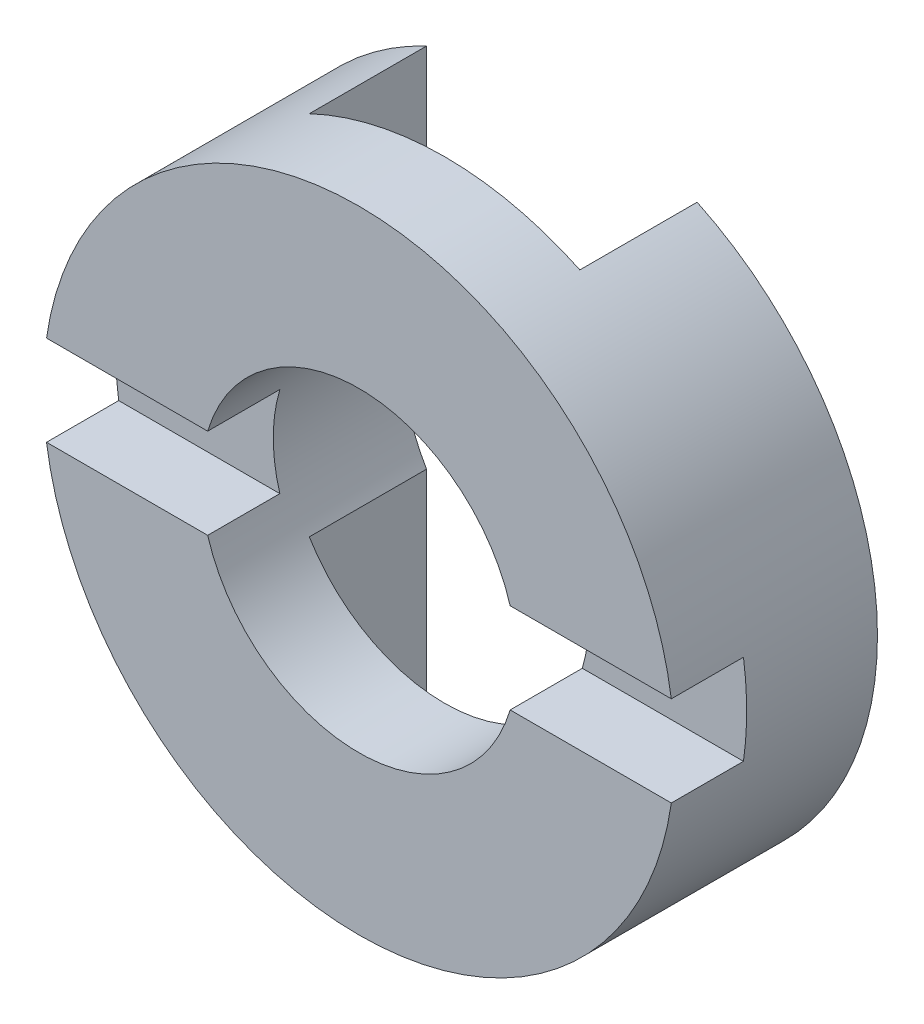
ISO-10303-21;
HEADER;
FILE_DESCRIPTION(('STEP AP214'),'2;1');
FILE_NAME('part.step','',(''),(''),'','','');
FILE_SCHEMA(('AUTOMOTIVE_DESIGN { 1 0 10303 214 1 1 1 1 }'));
ENDSEC;
DATA;
#1=APPLICATION_CONTEXT('core data for automotive mechanical design processes');
#2=APPLICATION_PROTOCOL_DEFINITION('international standard','automotive_design',2000,#1);
#3=PRODUCT_CONTEXT('',#1,'mechanical');
#4=PRODUCT('Part','Part','',(#3));
#5=PRODUCT_RELATED_PRODUCT_CATEGORY('part','',(#4));
#6=PRODUCT_DEFINITION_FORMATION('','',#4);
#7=PRODUCT_DEFINITION_CONTEXT('part definition',#1,'design');
#8=PRODUCT_DEFINITION('design','',#6,#7);
#9=PRODUCT_DEFINITION_SHAPE('','',#8);
#10=(LENGTH_UNIT() NAMED_UNIT(*) SI_UNIT(.MILLI.,.METRE.));
#11=(NAMED_UNIT(*) PLANE_ANGLE_UNIT() SI_UNIT($,.RADIAN.));
#12=(NAMED_UNIT(*) SI_UNIT($,.STERADIAN.) SOLID_ANGLE_UNIT());
#13=UNCERTAINTY_MEASURE_WITH_UNIT(LENGTH_MEASURE(1.E-05),#10,'distance_accuracy_value','');
#14=(GEOMETRIC_REPRESENTATION_CONTEXT(3) GLOBAL_UNCERTAINTY_ASSIGNED_CONTEXT((#13)) GLOBAL_UNIT_ASSIGNED_CONTEXT((#10,
#11,#12)) REPRESENTATION_CONTEXT('',''));
#15=CARTESIAN_POINT('',(0.,0.,0.));
#16=DIRECTION('',(0.,0.,1.));
#17=DIRECTION('',(1.,0.,0.));
#18=AXIS2_PLACEMENT_3D('',#15,#16,#17);
#19=CARTESIAN_POINT('',(0.,-15.5414213562373,4.5));
#20=DIRECTION('',(0.,0.,1.));
#21=DIRECTION('',(1.,0.,0.));
#22=AXIS2_PLACEMENT_3D('',#19,#20,#21);
#23=PLANE('',#22);
#24=DIRECTION('',(-1.,0.,0.));
#25=VECTOR('',#24,1.);
#26=CARTESIAN_POINT('',(0.,0.999999999999999,4.5));
#27=LINE('',#26,#25);
#28=CARTESIAN_POINT('',(6.92820323027551,1.,4.5));
#29=VERTEX_POINT('',#28);
#30=CARTESIAN_POINT('',(3.35410196624969,1.,4.5));
#31=VERTEX_POINT('',#30);
#32=EDGE_CURVE('E243',#29,#31,#27,.T.);
#33=ORIENTED_EDGE('',*,*,#32,.F.);
#34=CARTESIAN_POINT('',(0.,0.,4.5));
#35=DIRECTION('',(0.,0.,1.));
#36=DIRECTION('',(1.,0.,0.));
#37=AXIS2_PLACEMENT_3D('',#34,#35,#36);
#38=CIRCLE('',#37,7.);
#39=CARTESIAN_POINT('',(-6.92820323027551,1.,4.5));
#40=VERTEX_POINT('',#39);
#41=EDGE_CURVE('E217',#40,#29,#38,.F.);
#42=ORIENTED_EDGE('',*,*,#41,.F.);
#43=CARTESIAN_POINT('',(-3.35410196624968,1.,4.5));
#44=VERTEX_POINT('',#43);
#45=EDGE_CURVE('E242',#44,#40,#27,.T.);
#46=ORIENTED_EDGE('',*,*,#45,.F.);
#47=CARTESIAN_POINT('',(0.,0.,4.5));
#48=DIRECTION('',(0.,0.,1.));
#49=DIRECTION('',(1.,0.,0.));
#50=AXIS2_PLACEMENT_3D('',#47,#48,#49);
#51=CIRCLE('',#50,3.5);
#52=EDGE_CURVE('E214',#31,#44,#51,.T.);
#53=ORIENTED_EDGE('',*,*,#52,.F.);
#54=EDGE_LOOP('',(#33,#42,#46,#53));
#55=FACE_BOUND('',#54,.T.);
#56=ADVANCED_FACE('F33',(#55),#23,.T.);
#57=CARTESIAN_POINT('',(0.,-15.5414213562373,0.));
#58=DIRECTION('',(0.,0.,1.));
#59=DIRECTION('',(1.,0.,0.));
#60=AXIS2_PLACEMENT_3D('',#57,#58,#59);
#61=PLANE('',#60);
#62=CARTESIAN_POINT('',(0.,0.,0.));
#63=DIRECTION('',(0.,0.,1.));
#64=DIRECTION('',(1.,0.,0.));
#65=AXIS2_PLACEMENT_3D('',#62,#63,#64);
#66=CIRCLE('',#65,7.);
#67=CARTESIAN_POINT('',(-3.,-6.32455532033676,0.));
#68=VERTEX_POINT('',#67);
#69=CARTESIAN_POINT('',(-3.,6.32455532033676,0.));
#70=VERTEX_POINT('',#69);
#71=EDGE_CURVE('E228',#68,#70,#66,.F.);
#72=ORIENTED_EDGE('',*,*,#71,.T.);
#73=DIRECTION('',(0.,-1.,0.));
#74=VECTOR('',#73,1.);
#75=CARTESIAN_POINT('',(-3.,-15.5414213562373,0.));
#76=LINE('',#75,#74);
#77=CARTESIAN_POINT('',(-3.,1.80277563773199,0.));
#78=VERTEX_POINT('',#77);
#79=EDGE_CURVE('E236',#70,#78,#76,.T.);
#80=ORIENTED_EDGE('',*,*,#79,.T.);
#81=CARTESIAN_POINT('',(0.,0.,0.));
#82=DIRECTION('',(0.,0.,1.));
#83=DIRECTION('',(1.,0.,0.));
#84=AXIS2_PLACEMENT_3D('',#81,#82,#83);
#85=CIRCLE('',#84,3.5);
#86=CARTESIAN_POINT('',(-3.,-1.802775637732,0.));
#87=VERTEX_POINT('',#86);
#88=EDGE_CURVE('E224',#78,#87,#85,.T.);
#89=ORIENTED_EDGE('',*,*,#88,.T.);
#90=EDGE_CURVE('E233',#87,#68,#76,.T.);
#91=ORIENTED_EDGE('',*,*,#90,.T.);
#92=EDGE_LOOP('',(#72,#80,#89,#91));
#93=FACE_BOUND('',#92,.T.);
#94=ADVANCED_FACE('F257',(#93),#61,.F.);
#95=CARTESIAN_POINT('',(0.,0.,4.5));
#96=DIRECTION('',(0.,0.,-1.));
#97=DIRECTION('',(-1.,0.,0.));
#98=AXIS2_PLACEMENT_3D('',#95,#96,#97);
#99=CYLINDRICAL_SURFACE('',#98,3.5);
#100=DIRECTION('',(0.,0.,-1.));
#101=VECTOR('',#100,1.);
#102=CARTESIAN_POINT('',(-3.35410196624968,1.,4.5));
#103=LINE('',#102,#101);
#104=CARTESIAN_POINT('',(-3.35410196624968,1.,2.9));
#105=VERTEX_POINT('',#104);
#106=EDGE_CURVE('E178',#105,#44,#103,.F.);
#107=ORIENTED_EDGE('',*,*,#106,.F.);
#108=CARTESIAN_POINT('',(0.,0.,2.9));
#109=DIRECTION('',(0.,0.,-1.));
#110=DIRECTION('',(-1.,0.,0.));
#111=AXIS2_PLACEMENT_3D('',#108,#109,#110);
#112=CIRCLE('',#111,3.5);
#113=CARTESIAN_POINT('',(-3.35410196624968,-1.,2.9));
#114=VERTEX_POINT('',#113);
#115=EDGE_CURVE('E182',#114,#105,#112,.T.);
#116=ORIENTED_EDGE('',*,*,#115,.F.);
#117=DIRECTION('',(0.,0.,-1.));
#118=VECTOR('',#117,1.);
#119=CARTESIAN_POINT('',(-3.35410196624968,-1.,4.5));
#120=LINE('',#119,#118);
#121=CARTESIAN_POINT('',(-3.35410196624968,-1.,4.5));
#122=VERTEX_POINT('',#121);
#123=EDGE_CURVE('E157',#122,#114,#120,.T.);
#124=ORIENTED_EDGE('',*,*,#123,.F.);
#125=CARTESIAN_POINT('',(3.35410196624968,-0.999999999999999,4.5));
#126=VERTEX_POINT('',#125);
#127=EDGE_CURVE('E218',#122,#126,#51,.T.);
#128=ORIENTED_EDGE('',*,*,#127,.T.);
#129=DIRECTION('',(0.,0.,-1.));
#130=VECTOR('',#129,1.);
#131=CARTESIAN_POINT('',(3.35410196624968,-1.,4.5));
#132=LINE('',#131,#130);
#133=CARTESIAN_POINT('',(3.35410196624969,-1.,2.9));
#134=VERTEX_POINT('',#133);
#135=EDGE_CURVE('E56',#134,#126,#132,.F.);
#136=ORIENTED_EDGE('',*,*,#135,.F.);
#137=CARTESIAN_POINT('',(3.35410196624968,1.,2.9));
#138=VERTEX_POINT('',#137);
#139=EDGE_CURVE('E184',#138,#134,#112,.T.);
#140=ORIENTED_EDGE('',*,*,#139,.F.);
#141=DIRECTION('',(0.,0.,-1.));
#142=VECTOR('',#141,1.);
#143=CARTESIAN_POINT('',(3.35410196624968,1.,4.5));
#144=LINE('',#143,#142);
#145=EDGE_CURVE('E180',#31,#138,#144,.T.);
#146=ORIENTED_EDGE('',*,*,#145,.F.);
#147=ORIENTED_EDGE('',*,*,#52,.T.);
#148=EDGE_LOOP('',(#107,#116,#124,#128,#136,#140,#146,#147));
#149=FACE_BOUND('',#148,.T.);
#150=DIRECTION('',(0.,0.,-1.));
#151=VECTOR('',#150,1.);
#152=CARTESIAN_POINT('',(-3.,1.80277563773199,4.5));
#153=LINE('',#152,#151);
#154=CARTESIAN_POINT('',(-3.,1.802775637732,2.6));
#155=VERTEX_POINT('',#154);
#156=EDGE_CURVE('E209',#155,#78,#153,.T.);
#157=ORIENTED_EDGE('',*,*,#156,.F.);
#158=CARTESIAN_POINT('',(0.,0.,2.6));
#159=DIRECTION('',(0.,0.,1.));
#160=DIRECTION('',(1.,0.,0.));
#161=AXIS2_PLACEMENT_3D('',#158,#159,#160);
#162=CIRCLE('',#161,3.5);
#163=CARTESIAN_POINT('',(3.,1.802775637732,2.6));
#164=VERTEX_POINT('',#163);
#165=EDGE_CURVE('E213',#164,#155,#162,.T.);
#166=ORIENTED_EDGE('',*,*,#165,.F.);
#167=DIRECTION('',(0.,0.,-1.));
#168=VECTOR('',#167,1.);
#169=CARTESIAN_POINT('',(3.,1.80277563773199,4.5));
#170=LINE('',#169,#168);
#171=CARTESIAN_POINT('',(3.,1.80277563773199,0.));
#172=VERTEX_POINT('',#171);
#173=EDGE_CURVE('E198',#172,#164,#170,.F.);
#174=ORIENTED_EDGE('',*,*,#173,.F.);
#175=CARTESIAN_POINT('',(3.,-1.802775637732,0.));
#176=VERTEX_POINT('',#175);
#177=EDGE_CURVE('E221',#176,#172,#85,.T.);
#178=ORIENTED_EDGE('',*,*,#177,.F.);
#179=DIRECTION('',(0.,0.,-1.));
#180=VECTOR('',#179,1.);
#181=CARTESIAN_POINT('',(3.,-1.80277563773199,4.5));
#182=LINE('',#181,#180);
#183=CARTESIAN_POINT('',(3.,-1.802775637732,2.6));
#184=VERTEX_POINT('',#183);
#185=EDGE_CURVE('E200',#184,#176,#182,.T.);
#186=ORIENTED_EDGE('',*,*,#185,.F.);
#187=CARTESIAN_POINT('',(-3.,-1.802775637732,2.6));
#188=VERTEX_POINT('',#187);
#189=EDGE_CURVE('E211',#188,#184,#162,.T.);
#190=ORIENTED_EDGE('',*,*,#189,.F.);
#191=DIRECTION('',(0.,0.,-1.));
#192=VECTOR('',#191,1.);
#193=CARTESIAN_POINT('',(-3.,-1.80277563773199,4.5));
#194=LINE('',#193,#192);
#195=EDGE_CURVE('E207',#87,#188,#194,.F.);
#196=ORIENTED_EDGE('',*,*,#195,.F.);
#197=ORIENTED_EDGE('',*,*,#88,.F.);
#198=EDGE_LOOP('',(#157,#166,#174,#178,#186,#190,#196,#197));
#199=FACE_BOUND('',#198,.T.);
#200=ADVANCED_FACE('F35',(#149,#199),#99,.F.);
#201=CARTESIAN_POINT('',(0.,0.,4.5));
#202=DIRECTION('',(0.,0.,-1.));
#203=DIRECTION('',(-1.,0.,0.));
#204=AXIS2_PLACEMENT_3D('',#201,#202,#203);
#205=CYLINDRICAL_SURFACE('',#204,7.);
#206=DIRECTION('',(0.,0.,-1.));
#207=VECTOR('',#206,1.);
#208=CARTESIAN_POINT('',(-6.92820323027551,-1.,4.5));
#209=LINE('',#208,#207);
#210=CARTESIAN_POINT('',(-6.92820323027551,-1.,2.9));
#211=VERTEX_POINT('',#210);
#212=CARTESIAN_POINT('',(-6.92820323027551,-0.999999999999999,4.5));
#213=VERTEX_POINT('',#212);
#214=EDGE_CURVE('E48',#211,#213,#209,.F.);
#215=ORIENTED_EDGE('',*,*,#214,.F.);
#216=CARTESIAN_POINT('',(0.,0.,2.9));
#217=DIRECTION('',(0.,0.,-1.));
#218=DIRECTION('',(-1.,0.,0.));
#219=AXIS2_PLACEMENT_3D('',#216,#217,#218);
#220=CIRCLE('',#219,7.);
#221=CARTESIAN_POINT('',(-6.92820323027551,1.,2.9));
#222=VERTEX_POINT('',#221);
#223=EDGE_CURVE('E11',#222,#211,#220,.F.);
#224=ORIENTED_EDGE('',*,*,#223,.F.);
#225=DIRECTION('',(0.,0.,-1.));
#226=VECTOR('',#225,1.);
#227=CARTESIAN_POINT('',(-6.92820323027551,1.,4.5));
#228=LINE('',#227,#226);
#229=EDGE_CURVE('E174',#40,#222,#228,.T.);
#230=ORIENTED_EDGE('',*,*,#229,.F.);
#231=ORIENTED_EDGE('',*,*,#41,.T.);
#232=DIRECTION('',(0.,0.,-1.));
#233=VECTOR('',#232,1.);
#234=CARTESIAN_POINT('',(6.92820323027551,1.,4.5));
#235=LINE('',#234,#233);
#236=CARTESIAN_POINT('',(6.92820323027551,1.,2.9));
#237=VERTEX_POINT('',#236);
#238=EDGE_CURVE('E176',#237,#29,#235,.F.);
#239=ORIENTED_EDGE('',*,*,#238,.F.);
#240=CARTESIAN_POINT('',(6.92820323027551,-1.,2.9));
#241=VERTEX_POINT('',#240);
#242=EDGE_CURVE('E37',#241,#237,#220,.F.);
#243=ORIENTED_EDGE('',*,*,#242,.F.);
#244=DIRECTION('',(0.,0.,-1.));
#245=VECTOR('',#244,1.);
#246=CARTESIAN_POINT('',(6.92820323027551,-1.,4.5));
#247=LINE('',#246,#245);
#248=CARTESIAN_POINT('',(6.92820323027551,-1.,4.5));
#249=VERTEX_POINT('',#248);
#250=EDGE_CURVE('E167',#249,#241,#247,.T.);
#251=ORIENTED_EDGE('',*,*,#250,.F.);
#252=EDGE_CURVE('E166',#249,#213,#38,.F.);
#253=ORIENTED_EDGE('',*,*,#252,.T.);
#254=EDGE_LOOP('',(#215,#224,#230,#231,#239,#243,#251,#253));
#255=FACE_BOUND('',#254,.T.);
#256=DIRECTION('',(0.,0.,-1.));
#257=VECTOR('',#256,1.);
#258=CARTESIAN_POINT('',(3.,-6.32455532033676,4.5));
#259=LINE('',#258,#257);
#260=CARTESIAN_POINT('',(3.,-6.32455532033676,0.));
#261=VERTEX_POINT('',#260);
#262=CARTESIAN_POINT('',(3.,-6.32455532033676,2.6));
#263=VERTEX_POINT('',#262);
#264=EDGE_CURVE('E195',#261,#263,#259,.F.);
#265=ORIENTED_EDGE('',*,*,#264,.F.);
#266=CARTESIAN_POINT('',(3.,6.32455532033676,0.));
#267=VERTEX_POINT('',#266);
#268=EDGE_CURVE('E225',#267,#261,#66,.F.);
#269=ORIENTED_EDGE('',*,*,#268,.F.);
#270=DIRECTION('',(0.,0.,-1.));
#271=VECTOR('',#270,1.);
#272=CARTESIAN_POINT('',(3.,6.32455532033676,4.5));
#273=LINE('',#272,#271);
#274=CARTESIAN_POINT('',(3.,6.32455532033676,2.6));
#275=VERTEX_POINT('',#274);
#276=EDGE_CURVE('E193',#275,#267,#273,.T.);
#277=ORIENTED_EDGE('',*,*,#276,.F.);
#278=CARTESIAN_POINT('',(0.,0.,2.6));
#279=DIRECTION('',(0.,0.,1.));
#280=DIRECTION('',(1.,0.,0.));
#281=AXIS2_PLACEMENT_3D('',#278,#279,#280);
#282=CIRCLE('',#281,7.);
#283=CARTESIAN_POINT('',(-3.,6.32455532033676,2.6));
#284=VERTEX_POINT('',#283);
#285=EDGE_CURVE('E237',#284,#275,#282,.F.);
#286=ORIENTED_EDGE('',*,*,#285,.F.);
#287=DIRECTION('',(0.,0.,-1.));
#288=VECTOR('',#287,1.);
#289=CARTESIAN_POINT('',(-3.,6.32455532033676,4.5));
#290=LINE('',#289,#288);
#291=EDGE_CURVE('E204',#70,#284,#290,.F.);
#292=ORIENTED_EDGE('',*,*,#291,.F.);
#293=ORIENTED_EDGE('',*,*,#71,.F.);
#294=DIRECTION('',(0.,0.,-1.));
#295=VECTOR('',#294,1.);
#296=CARTESIAN_POINT('',(-3.,-6.32455532033676,4.5));
#297=LINE('',#296,#295);
#298=CARTESIAN_POINT('',(-3.,-6.32455532033676,2.6));
#299=VERTEX_POINT('',#298);
#300=EDGE_CURVE('E202',#299,#68,#297,.T.);
#301=ORIENTED_EDGE('',*,*,#300,.F.);
#302=EDGE_CURVE('E239',#263,#299,#282,.F.);
#303=ORIENTED_EDGE('',*,*,#302,.F.);
#304=EDGE_LOOP('',(#265,#269,#277,#286,#292,#293,#301,#303));
#305=FACE_BOUND('',#304,.T.);
#306=ADVANCED_FACE('F162',(#255,#305),#205,.T.);
#307=DIRECTION('',(1.,0.,0.));
#308=VECTOR('',#307,1.);
#309=CARTESIAN_POINT('',(0.,-0.999999999999999,4.5));
#310=LINE('',#309,#308);
#311=EDGE_CURVE('E241',#213,#122,#310,.T.);
#312=ORIENTED_EDGE('',*,*,#311,.F.);
#313=ORIENTED_EDGE('',*,*,#252,.F.);
#314=EDGE_CURVE('E240',#126,#249,#310,.T.);
#315=ORIENTED_EDGE('',*,*,#314,.F.);
#316=ORIENTED_EDGE('',*,*,#127,.F.);
#317=EDGE_LOOP('',(#312,#313,#315,#316));
#318=FACE_BOUND('',#317,.T.);
#319=ADVANCED_FACE('F252',(#318),#23,.T.);
#320=ORIENTED_EDGE('',*,*,#268,.T.);
#321=DIRECTION('',(0.,1.,0.));
#322=VECTOR('',#321,1.);
#323=CARTESIAN_POINT('',(3.,-15.5414213562373,0.));
#324=LINE('',#323,#322);
#325=EDGE_CURVE('E232',#261,#176,#324,.T.);
#326=ORIENTED_EDGE('',*,*,#325,.T.);
#327=ORIENTED_EDGE('',*,*,#177,.T.);
#328=EDGE_CURVE('E229',#172,#267,#324,.T.);
#329=ORIENTED_EDGE('',*,*,#328,.T.);
#330=EDGE_LOOP('',(#320,#326,#327,#329));
#331=FACE_BOUND('',#330,.T.);
#332=ADVANCED_FACE('F290',(#331),#61,.F.);
#333=CARTESIAN_POINT('',(-3.,-7.,0.));
#334=DIRECTION('',(-1.,0.,0.));
#335=DIRECTION('',(0.,0.,1.));
#336=AXIS2_PLACEMENT_3D('',#333,#334,#335);
#337=PLANE('',#336);
#338=ORIENTED_EDGE('',*,*,#156,.T.);
#339=ORIENTED_EDGE('',*,*,#79,.F.);
#340=ORIENTED_EDGE('',*,*,#291,.T.);
#341=DIRECTION('',(0.,1.,0.));
#342=VECTOR('',#341,1.);
#343=CARTESIAN_POINT('',(-3.,-7.,2.6));
#344=LINE('',#343,#342);
#345=EDGE_CURVE('E190',#155,#284,#344,.T.);
#346=ORIENTED_EDGE('',*,*,#345,.F.);
#347=EDGE_LOOP('',(#338,#339,#340,#346));
#348=FACE_BOUND('',#347,.T.);
#349=ADVANCED_FACE('F266',(#348),#337,.F.);
#350=CARTESIAN_POINT('',(3.,-7.,0.));
#351=DIRECTION('',(1.,0.,0.));
#352=DIRECTION('',(0.,0.,-1.));
#353=AXIS2_PLACEMENT_3D('',#350,#351,#352);
#354=PLANE('',#353);
#355=ORIENTED_EDGE('',*,*,#173,.T.);
#356=DIRECTION('',(0.,1.,0.));
#357=VECTOR('',#356,1.);
#358=CARTESIAN_POINT('',(3.,-7.,2.6));
#359=LINE('',#358,#357);
#360=EDGE_CURVE('E185',#164,#275,#359,.T.);
#361=ORIENTED_EDGE('',*,*,#360,.T.);
#362=ORIENTED_EDGE('',*,*,#276,.T.);
#363=ORIENTED_EDGE('',*,*,#328,.F.);
#364=EDGE_LOOP('',(#355,#361,#362,#363));
#365=FACE_BOUND('',#364,.T.);
#366=ADVANCED_FACE('F292',(#365),#354,.F.);
#367=CARTESIAN_POINT('',(-3.,-7.,2.6));
#368=DIRECTION('',(0.,0.,1.));
#369=DIRECTION('',(1.,0.,0.));
#370=AXIS2_PLACEMENT_3D('',#367,#368,#369);
#371=PLANE('',#370);
#372=ORIENTED_EDGE('',*,*,#165,.T.);
#373=ORIENTED_EDGE('',*,*,#345,.T.);
#374=ORIENTED_EDGE('',*,*,#285,.T.);
#375=ORIENTED_EDGE('',*,*,#360,.F.);
#376=EDGE_LOOP('',(#372,#373,#374,#375));
#377=FACE_BOUND('',#376,.T.);
#378=ADVANCED_FACE('F269',(#377),#371,.F.);
#379=ORIENTED_EDGE('',*,*,#185,.T.);
#380=ORIENTED_EDGE('',*,*,#325,.F.);
#381=ORIENTED_EDGE('',*,*,#264,.T.);
#382=EDGE_CURVE('E188',#263,#184,#359,.T.);
#383=ORIENTED_EDGE('',*,*,#382,.T.);
#384=EDGE_LOOP('',(#379,#380,#381,#383));
#385=FACE_BOUND('',#384,.T.);
#386=ADVANCED_FACE('F287',(#385),#354,.F.);
#387=ORIENTED_EDGE('',*,*,#195,.T.);
#388=EDGE_CURVE('E189',#299,#188,#344,.T.);
#389=ORIENTED_EDGE('',*,*,#388,.F.);
#390=ORIENTED_EDGE('',*,*,#300,.T.);
#391=ORIENTED_EDGE('',*,*,#90,.F.);
#392=EDGE_LOOP('',(#387,#389,#390,#391));
#393=FACE_BOUND('',#392,.T.);
#394=ADVANCED_FACE('F280',(#393),#337,.F.);
#395=ORIENTED_EDGE('',*,*,#189,.T.);
#396=ORIENTED_EDGE('',*,*,#382,.F.);
#397=ORIENTED_EDGE('',*,*,#302,.T.);
#398=ORIENTED_EDGE('',*,*,#388,.T.);
#399=EDGE_LOOP('',(#395,#396,#397,#398));
#400=FACE_BOUND('',#399,.T.);
#401=ADVANCED_FACE('F282',(#400),#371,.F.);
#402=CARTESIAN_POINT('',(-7.,-1.,4.5));
#403=DIRECTION('',(0.,-1.,0.));
#404=DIRECTION('',(0.,0.,-1.));
#405=AXIS2_PLACEMENT_3D('',#402,#403,#404);
#406=PLANE('',#405);
#407=ORIENTED_EDGE('',*,*,#135,.T.);
#408=ORIENTED_EDGE('',*,*,#314,.T.);
#409=ORIENTED_EDGE('',*,*,#250,.T.);
#410=DIRECTION('',(1.,0.,0.));
#411=VECTOR('',#410,1.);
#412=CARTESIAN_POINT('',(-7.,-1.,2.9));
#413=LINE('',#412,#411);
#414=EDGE_CURVE('E159',#134,#241,#413,.T.);
#415=ORIENTED_EDGE('',*,*,#414,.F.);
#416=EDGE_LOOP('',(#407,#408,#409,#415));
#417=FACE_BOUND('',#416,.T.);
#418=ADVANCED_FACE('F371',(#417),#406,.F.);
#419=CARTESIAN_POINT('',(-7.,1.,4.5));
#420=DIRECTION('',(0.,1.,0.));
#421=DIRECTION('',(0.,0.,1.));
#422=AXIS2_PLACEMENT_3D('',#419,#420,#421);
#423=PLANE('',#422);
#424=ORIENTED_EDGE('',*,*,#145,.T.);
#425=DIRECTION('',(1.,0.,0.));
#426=VECTOR('',#425,1.);
#427=CARTESIAN_POINT('',(-7.,1.,2.9));
#428=LINE('',#427,#426);
#429=EDGE_CURVE('E158',#138,#237,#428,.T.);
#430=ORIENTED_EDGE('',*,*,#429,.T.);
#431=ORIENTED_EDGE('',*,*,#238,.T.);
#432=ORIENTED_EDGE('',*,*,#32,.T.);
#433=EDGE_LOOP('',(#424,#430,#431,#432));
#434=FACE_BOUND('',#433,.T.);
#435=ADVANCED_FACE('F389',(#434),#423,.F.);
#436=CARTESIAN_POINT('',(-7.,1.,2.9));
#437=DIRECTION('',(0.,0.,-1.));
#438=DIRECTION('',(-1.,0.,0.));
#439=AXIS2_PLACEMENT_3D('',#436,#437,#438);
#440=PLANE('',#439);
#441=ORIENTED_EDGE('',*,*,#139,.T.);
#442=ORIENTED_EDGE('',*,*,#414,.T.);
#443=ORIENTED_EDGE('',*,*,#242,.T.);
#444=ORIENTED_EDGE('',*,*,#429,.F.);
#445=EDGE_LOOP('',(#441,#442,#443,#444));
#446=FACE_BOUND('',#445,.T.);
#447=ADVANCED_FACE('F396',(#446),#440,.F.);
#448=ORIENTED_EDGE('',*,*,#123,.T.);
#449=EDGE_CURVE('E149',#211,#114,#413,.T.);
#450=ORIENTED_EDGE('',*,*,#449,.F.);
#451=ORIENTED_EDGE('',*,*,#214,.T.);
#452=ORIENTED_EDGE('',*,*,#311,.T.);
#453=EDGE_LOOP('',(#448,#450,#451,#452));
#454=FACE_BOUND('',#453,.T.);
#455=ADVANCED_FACE('F155',(#454),#406,.F.);
#456=ORIENTED_EDGE('',*,*,#106,.T.);
#457=ORIENTED_EDGE('',*,*,#45,.T.);
#458=ORIENTED_EDGE('',*,*,#229,.T.);
#459=EDGE_CURVE('E152',#222,#105,#428,.T.);
#460=ORIENTED_EDGE('',*,*,#459,.T.);
#461=EDGE_LOOP('',(#456,#457,#458,#460));
#462=FACE_BOUND('',#461,.T.);
#463=ADVANCED_FACE('F399',(#462),#423,.F.);
#464=ORIENTED_EDGE('',*,*,#115,.T.);
#465=ORIENTED_EDGE('',*,*,#459,.F.);
#466=ORIENTED_EDGE('',*,*,#223,.T.);
#467=ORIENTED_EDGE('',*,*,#449,.T.);
#468=EDGE_LOOP('',(#464,#465,#466,#467));
#469=FACE_BOUND('',#468,.T.);
#470=ADVANCED_FACE('F148',(#469),#440,.F.);
#471=CLOSED_SHELL('',(#56,#94,#200,#306,#319,#332,#349,#366,#378,#386,#394,#401,#418,#435,#447,
#455,#463,#470));
#472=MANIFOLD_SOLID_BREP('B2',#471);
#473=ADVANCED_BREP_SHAPE_REPRESENTATION('',(#18,#472),#14);
#474=SHAPE_DEFINITION_REPRESENTATION(#9,#473);
ENDSEC;
END-ISO-10303-21;
